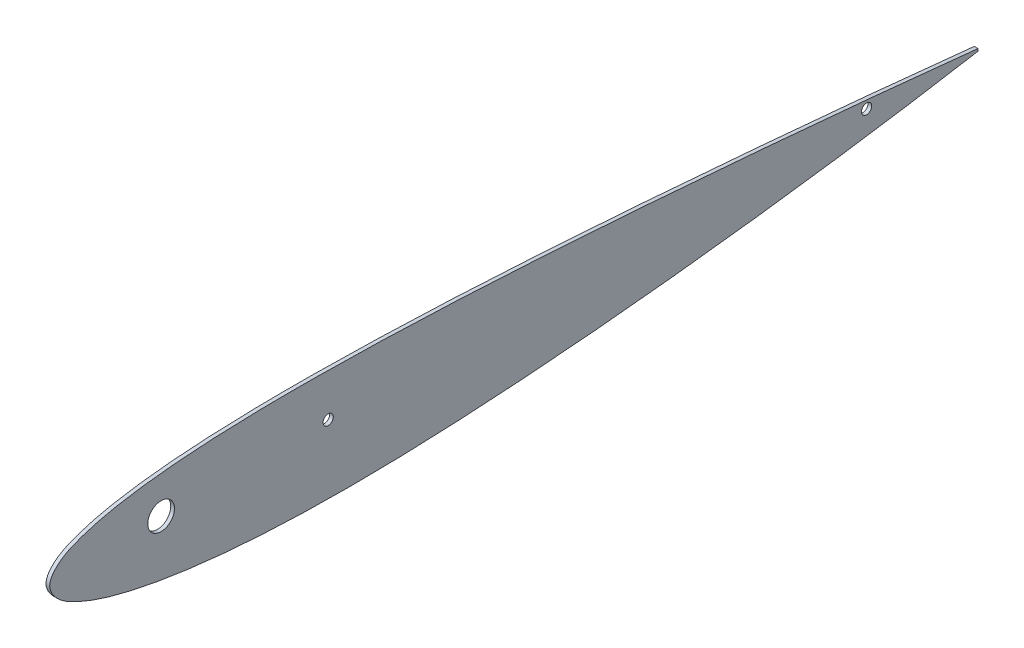
ISO-10303-21;
HEADER;
FILE_DESCRIPTION(('STEP AP214'),'2;1');
FILE_NAME('part.step','',(''),(''),'','','');
FILE_SCHEMA(('AUTOMOTIVE_DESIGN { 1 0 10303 214 1 1 1 1 }'));
ENDSEC;
DATA;
#1=APPLICATION_CONTEXT('core data for automotive mechanical design processes');
#2=APPLICATION_PROTOCOL_DEFINITION('international standard','automotive_design',2000,#1);
#3=PRODUCT_CONTEXT('',#1,'mechanical');
#4=PRODUCT('Part','Part','',(#3));
#5=PRODUCT_RELATED_PRODUCT_CATEGORY('part','',(#4));
#6=PRODUCT_DEFINITION_FORMATION('','',#4);
#7=PRODUCT_DEFINITION_CONTEXT('part definition',#1,'design');
#8=PRODUCT_DEFINITION('design','',#6,#7);
#9=PRODUCT_DEFINITION_SHAPE('','',#8);
#10=(LENGTH_UNIT() NAMED_UNIT(*) SI_UNIT(.MILLI.,.METRE.));
#11=(NAMED_UNIT(*) PLANE_ANGLE_UNIT() SI_UNIT($,.RADIAN.));
#12=(NAMED_UNIT(*) SI_UNIT($,.STERADIAN.) SOLID_ANGLE_UNIT());
#13=UNCERTAINTY_MEASURE_WITH_UNIT(LENGTH_MEASURE(1.E-05),#10,'distance_accuracy_value','');
#14=(GEOMETRIC_REPRESENTATION_CONTEXT(3) GLOBAL_UNCERTAINTY_ASSIGNED_CONTEXT((#13)) GLOBAL_UNIT_ASSIGNED_CONTEXT((#10,
#11,#12)) REPRESENTATION_CONTEXT('',''));
#15=CARTESIAN_POINT('',(0.,0.,0.));
#16=DIRECTION('',(0.,0.,1.));
#17=DIRECTION('',(1.,0.,0.));
#18=AXIS2_PLACEMENT_3D('',#15,#16,#17);
#19=CARTESIAN_POINT('',(2.,0.629990217552887,-500.000391464518));
#20=CARTESIAN_POINT('',(2.,1.51034175126108,-491.626931192415));
#21=CARTESIAN_POINT('',(2.,3.26887282570173,-474.900669551157));
#22=CARTESIAN_POINT('',(2.,6.57755116135666,-441.478024901199));
#23=CARTESIAN_POINT('',(2.,10.4506062125908,-399.75968393433));
#24=CARTESIAN_POINT('',(2.,14.7211772633211,-349.744612358999));
#25=CARTESIAN_POINT('',(2.,18.5892936363402,-299.79981397499));
#26=CARTESIAN_POINT('',(2.,21.8953680882773,-249.907411219679));
#27=CARTESIAN_POINT('',(2.,24.3721381282665,-200.117341253644));
#28=CARTESIAN_POINT('',(2.,25.5592845892216,-158.671272756386));
#29=CARTESIAN_POINT('',(2.,25.7289283148688,-125.568151797292));
#30=CARTESIAN_POINT('',(2.,25.3055282165276,-100.710481376144));
#31=CARTESIAN_POINT('',(2.,24.1073804683215,-75.7898961207131));
#32=CARTESIAN_POINT('',(2.,22.1864488821257,-54.9819243378212));
#33=CARTESIAN_POINT('',(2.,19.6696784029122,-38.2826088337678));
#34=CARTESIAN_POINT('',(2.,17.0750296516133,-25.6214069700581));
#35=CARTESIAN_POINT('',(2.,13.6752084008964,-14.8526657949537));
#36=CARTESIAN_POINT('',(2.,9.34354366510016,-5.48115663478327));
#37=CARTESIAN_POINT('',(2.,0.464115322413722,3.05752115720103));
#38=CARTESIAN_POINT('',(2.,-9.25154410103212,-4.56290295265366));
#39=CARTESIAN_POINT('',(2.,-14.4440662930239,-13.5406941054071));
#40=CARTESIAN_POINT('',(2.,-18.8274349648793,-24.0380165714359));
#41=CARTESIAN_POINT('',(2.,-22.5007793217448,-36.5482015339728));
#42=CARTESIAN_POINT('',(2.,-26.3525527265861,-53.1842112016427));
#43=CARTESIAN_POINT('',(2.,-29.7119988712829,-74.0823714612029));
#44=CARTESIAN_POINT('',(2.,-32.3644363625232,-99.2384453704401));
#45=CARTESIAN_POINT('',(2.,-33.8981341858284,-124.417757669678));
#46=CARTESIAN_POINT('',(2.,-34.8427950054599,-158.001666326896));
#47=CARTESIAN_POINT('',(2.,-34.1504063706173,-199.943449697897));
#48=CARTESIAN_POINT('',(2.,-31.3977787192568,-250.163999372924));
#49=CARTESIAN_POINT('',(2.,-27.3265644902248,-300.273534791434));
#50=CARTESIAN_POINT('',(2.,-22.1260328840813,-350.326490164144));
#51=CARTESIAN_POINT('',(2.,-15.9835680884625,-400.319447211552));
#52=CARTESIAN_POINT('',(2.,-10.0706032745586,-441.907987538052));
#53=CARTESIAN_POINT('',(2.,-4.87163762297868,-475.129555299215));
#54=CARTESIAN_POINT('',(2.,-2.043748956896,-491.710316251138));
#55=CARTESIAN_POINT('',(2.,-0.629990217552892,-499.999608535483));
#56=B_SPLINE_CURVE_WITH_KNOTS('',3,(#19,#20,#21,#22,#23,#24,#25,#26,#27,#28,#29,#30,#31,#32,#33,
#34,#35,#36,#37,#38,#39,#40,#41,#42,#43,#44,#45,#46,#47,#48,#49,#50,#51,#52,#53,#54,#55),
.UNSPECIFIED.,.F.,.F.,(4,1,1,1,1,1,1,1,1,1,1,1,1,1,1,1,1,1,1,1,1,1,1,1,1,1,1,1,1,1,1,1,1,1,4),
(0.,0.0247898444409783,0.049518527668585,0.0988869468263506,0.148148302407342,0.19731261260843,
0.246378146970664,0.295363956929404,0.34408374332352,0.368442721404916,0.392825641810401,
0.41727490319434,0.441884458853984,0.454325923101425,0.466947515660677,0.480022900195665,
0.487092053261674,0.498227884101779,0.509373674616872,0.516476673346114,0.529639133387933,
0.542377969647895,0.5549439711343,0.579861194114865,0.604653843655577,0.629394084082987,
0.654115914552988,0.703559499032186,0.752843021958462,0.802183907321177,0.851568359011207,
0.900997535580195,0.950476794201679,0.975241647297708,1.),.UNSPECIFIED.);
#57=DIRECTION('',(-1.,0.,0.));
#58=VECTOR('',#57,1.);
#59=SURFACE_OF_LINEAR_EXTRUSION('',#56,#58);
#60=CARTESIAN_POINT('',(0.,0.629990217552887,-500.000391464518));
#61=CARTESIAN_POINT('',(0.,1.51034175126108,-491.626931192415));
#62=CARTESIAN_POINT('',(0.,3.26887282570173,-474.900669551157));
#63=CARTESIAN_POINT('',(0.,6.57755116135666,-441.478024901199));
#64=CARTESIAN_POINT('',(0.,10.4506062125908,-399.75968393433));
#65=CARTESIAN_POINT('',(0.,14.7211772633211,-349.744612358999));
#66=CARTESIAN_POINT('',(0.,18.5892936363402,-299.79981397499));
#67=CARTESIAN_POINT('',(0.,21.8953680882773,-249.907411219679));
#68=CARTESIAN_POINT('',(0.,24.3721381282665,-200.117341253644));
#69=CARTESIAN_POINT('',(0.,25.5592845892216,-158.671272756386));
#70=CARTESIAN_POINT('',(0.,25.7289283148688,-125.568151797292));
#71=CARTESIAN_POINT('',(0.,25.3055282165276,-100.710481376144));
#72=CARTESIAN_POINT('',(0.,24.1073804683215,-75.7898961207131));
#73=CARTESIAN_POINT('',(0.,22.1864488821257,-54.9819243378212));
#74=CARTESIAN_POINT('',(0.,19.6696784029122,-38.2826088337678));
#75=CARTESIAN_POINT('',(0.,17.0750296516133,-25.6214069700581));
#76=CARTESIAN_POINT('',(0.,13.6752084008964,-14.8526657949537));
#77=CARTESIAN_POINT('',(0.,9.34354366510016,-5.48115663478327));
#78=CARTESIAN_POINT('',(0.,0.464115322413722,3.05752115720103));
#79=CARTESIAN_POINT('',(0.,-9.25154410103212,-4.56290295265366));
#80=CARTESIAN_POINT('',(0.,-14.4440662930239,-13.5406941054071));
#81=CARTESIAN_POINT('',(0.,-18.8274349648793,-24.0380165714359));
#82=CARTESIAN_POINT('',(0.,-22.5007793217448,-36.5482015339728));
#83=CARTESIAN_POINT('',(0.,-26.3525527265861,-53.1842112016427));
#84=CARTESIAN_POINT('',(0.,-29.7119988712829,-74.0823714612029));
#85=CARTESIAN_POINT('',(0.,-32.3644363625232,-99.2384453704401));
#86=CARTESIAN_POINT('',(0.,-33.8981341858284,-124.417757669678));
#87=CARTESIAN_POINT('',(0.,-34.8427950054599,-158.001666326896));
#88=CARTESIAN_POINT('',(0.,-34.1504063706173,-199.943449697897));
#89=CARTESIAN_POINT('',(0.,-31.3977787192568,-250.163999372924));
#90=CARTESIAN_POINT('',(0.,-27.3265644902248,-300.273534791434));
#91=CARTESIAN_POINT('',(0.,-22.1260328840813,-350.326490164144));
#92=CARTESIAN_POINT('',(0.,-15.9835680884625,-400.319447211552));
#93=CARTESIAN_POINT('',(0.,-10.0706032745586,-441.907987538052));
#94=CARTESIAN_POINT('',(0.,-4.87163762297868,-475.129555299215));
#95=CARTESIAN_POINT('',(0.,-2.043748956896,-491.710316251138));
#96=CARTESIAN_POINT('',(0.,-0.629990217552892,-499.999608535483));
#97=B_SPLINE_CURVE_WITH_KNOTS('',3,(#60,#61,#62,#63,#64,#65,#66,#67,#68,#69,#70,#71,#72,#73,#74,
#75,#76,#77,#78,#79,#80,#81,#82,#83,#84,#85,#86,#87,#88,#89,#90,#91,#92,#93,#94,#95,#96),
.UNSPECIFIED.,.F.,.F.,(4,1,1,1,1,1,1,1,1,1,1,1,1,1,1,1,1,1,1,1,1,1,1,1,1,1,1,1,1,1,1,1,1,1,4),
(0.,0.0247898444409783,0.049518527668585,0.0988869468263506,0.148148302407342,0.19731261260843,
0.246378146970664,0.295363956929404,0.34408374332352,0.368442721404916,0.392825641810401,
0.41727490319434,0.441884458853984,0.454325923101425,0.466947515660677,0.480022900195665,
0.487092053261674,0.498227884101779,0.509373674616872,0.516476673346114,0.529639133387933,
0.542377969647895,0.5549439711343,0.579861194114865,0.604653843655577,0.629394084082987,
0.654115914552988,0.703559499032186,0.752843021958462,0.802183907321177,0.851568359011207,
0.900997535580195,0.950476794201679,0.975241647297708,1.),.UNSPECIFIED.);
#98=CARTESIAN_POINT('',(0.,0.629990217552889,-500.000391464518));
#99=VERTEX_POINT('',#98);
#100=CARTESIAN_POINT('',(0.,-0.629990217552889,-499.999608535482));
#101=VERTEX_POINT('',#100);
#102=EDGE_CURVE('E69',#99,#101,#97,.T.);
#103=ORIENTED_EDGE('',*,*,#102,.T.);
#104=DIRECTION('',(-1.,0.,0.));
#105=VECTOR('',#104,1.);
#106=CARTESIAN_POINT('',(2.,-0.629990217552889,-499.999608535482));
#107=LINE('',#106,#105);
#108=CARTESIAN_POINT('',(2.,-0.629990217552889,-499.999608535482));
#109=VERTEX_POINT('',#108);
#110=EDGE_CURVE('E11',#109,#101,#107,.T.);
#111=ORIENTED_EDGE('',*,*,#110,.F.);
#112=CARTESIAN_POINT('',(2.,0.629990217552889,-500.000391464518));
#113=VERTEX_POINT('',#112);
#114=EDGE_CURVE('E68',#113,#109,#56,.T.);
#115=ORIENTED_EDGE('',*,*,#114,.F.);
#116=DIRECTION('',(-1.,0.,0.));
#117=VECTOR('',#116,1.);
#118=CARTESIAN_POINT('',(2.,0.629990217552889,-500.000391464518));
#119=LINE('',#118,#117);
#120=EDGE_CURVE('E45',#113,#99,#119,.T.);
#121=ORIENTED_EDGE('',*,*,#120,.T.);
#122=EDGE_LOOP('',(#103,#111,#115,#121));
#123=FACE_BOUND('',#122,.T.);
#124=ADVANCED_FACE('F35',(#123),#59,.F.);
#125=CARTESIAN_POINT('',(2.,0.629990217552889,-500.000391464518));
#126=DIRECTION('',(0.,0.000621381778835644,0.999999806942324));
#127=DIRECTION('',(0.,-0.999999806942324,0.000621381778835644));
#128=AXIS2_PLACEMENT_3D('',#125,#126,#127);
#129=PLANE('',#128);
#130=DIRECTION('',(0.,0.999999806942324,-0.000621381778835644));
#131=VECTOR('',#130,1.);
#132=CARTESIAN_POINT('',(0.,0.629990217552889,-500.000391464518));
#133=LINE('',#132,#131);
#134=EDGE_CURVE('E61',#101,#99,#133,.T.);
#135=ORIENTED_EDGE('',*,*,#134,.T.);
#136=ORIENTED_EDGE('',*,*,#120,.F.);
#137=DIRECTION('',(0.,0.999999806942324,-0.000621381778835644));
#138=VECTOR('',#137,1.);
#139=CARTESIAN_POINT('',(2.,0.629990217552889,-500.000391464518));
#140=LINE('',#139,#138);
#141=EDGE_CURVE('E53',#109,#113,#140,.T.);
#142=ORIENTED_EDGE('',*,*,#141,.F.);
#143=ORIENTED_EDGE('',*,*,#110,.T.);
#144=EDGE_LOOP('',(#135,#136,#142,#143));
#145=FACE_BOUND('',#144,.T.);
#146=ADVANCED_FACE('F64',(#145),#129,.F.);
#147=CARTESIAN_POINT('',(2.,-1.37907631788879,-0.144206161930642));
#148=DIRECTION('',(1.,0.,0.));
#149=DIRECTION('',(0.,0.,-1.));
#150=AXIS2_PLACEMENT_3D('',#147,#148,#149);
#151=PLANE('',#150);
#152=CARTESIAN_POINT('',(2.,2.5000018824215,-60.));
#153=DIRECTION('',(1.,0.,0.));
#154=DIRECTION('',(0.,0.,-1.));
#155=AXIS2_PLACEMENT_3D('',#152,#153,#154);
#156=CIRCLE('',#155,7.19536101);
#157=CARTESIAN_POINT('',(2.,2.5000018824215,-67.19536101));
#158=VERTEX_POINT('',#157);
#159=EDGE_CURVE('E86',#158,#158,#156,.T.);
#160=ORIENTED_EDGE('',*,*,#159,.F.);
#161=EDGE_LOOP('',(#160));
#162=FACE_BOUND('',#161,.T.);
#163=CARTESIAN_POINT('',(2.,2.5000018824215,-150.));
#164=DIRECTION('',(1.,0.,0.));
#165=DIRECTION('',(0.,0.,-1.));
#166=AXIS2_PLACEMENT_3D('',#163,#164,#165);
#167=CIRCLE('',#166,2.75000000000001);
#168=CARTESIAN_POINT('',(2.,2.5000018824215,-152.75));
#169=VERTEX_POINT('',#168);
#170=EDGE_CURVE('E163',#169,#169,#167,.T.);
#171=ORIENTED_EDGE('',*,*,#170,.F.);
#172=EDGE_LOOP('',(#171));
#173=FACE_BOUND('',#172,.T.);
#174=CARTESIAN_POINT('',(2.,2.50000188242148,-440.001541872454));
#175=DIRECTION('',(1.,0.,0.));
#176=DIRECTION('',(0.,0.,-1.));
#177=AXIS2_PLACEMENT_3D('',#174,#175,#176);
#178=CIRCLE('',#177,2.75000000000004);
#179=CARTESIAN_POINT('',(2.,2.50000188242148,-442.751541872454));
#180=VERTEX_POINT('',#179);
#181=EDGE_CURVE('E166',#180,#180,#178,.T.);
#182=ORIENTED_EDGE('',*,*,#181,.F.);
#183=EDGE_LOOP('',(#182));
#184=FACE_BOUND('',#183,.T.);
#185=ORIENTED_EDGE('',*,*,#114,.T.);
#186=ORIENTED_EDGE('',*,*,#141,.T.);
#187=EDGE_LOOP('',(#185,#186));
#188=FACE_BOUND('',#187,.T.);
#189=ADVANCED_FACE('F111',(#162,#173,#184,#188),#151,.T.);
#190=CARTESIAN_POINT('',(0.,-1.37907631788879,-0.144206161930642));
#191=DIRECTION('',(1.,0.,0.));
#192=DIRECTION('',(0.,0.,-1.));
#193=AXIS2_PLACEMENT_3D('',#190,#191,#192);
#194=PLANE('',#193);
#195=CARTESIAN_POINT('',(0.,2.5000018824215,-60.));
#196=DIRECTION('',(1.,0.,0.));
#197=DIRECTION('',(0.,0.,-1.));
#198=AXIS2_PLACEMENT_3D('',#195,#196,#197);
#199=CIRCLE('',#198,7.19536101);
#200=CARTESIAN_POINT('',(0.,2.5000018824215,-67.19536101));
#201=VERTEX_POINT('',#200);
#202=EDGE_CURVE('E39',#201,#201,#199,.T.);
#203=ORIENTED_EDGE('',*,*,#202,.T.);
#204=EDGE_LOOP('',(#203));
#205=FACE_BOUND('',#204,.T.);
#206=CARTESIAN_POINT('',(0.,2.5000018824215,-150.));
#207=DIRECTION('',(1.,0.,0.));
#208=DIRECTION('',(0.,0.,-1.));
#209=AXIS2_PLACEMENT_3D('',#206,#207,#208);
#210=CIRCLE('',#209,2.75000000000001);
#211=CARTESIAN_POINT('',(0.,2.5000018824215,-152.75));
#212=VERTEX_POINT('',#211);
#213=EDGE_CURVE('E76',#212,#212,#210,.T.);
#214=ORIENTED_EDGE('',*,*,#213,.T.);
#215=EDGE_LOOP('',(#214));
#216=FACE_BOUND('',#215,.T.);
#217=CARTESIAN_POINT('',(0.,2.50000188242148,-440.001541872454));
#218=DIRECTION('',(1.,0.,0.));
#219=DIRECTION('',(0.,0.,-1.));
#220=AXIS2_PLACEMENT_3D('',#217,#218,#219);
#221=CIRCLE('',#220,2.75000000000004);
#222=CARTESIAN_POINT('',(0.,2.50000188242148,-442.751541872454));
#223=VERTEX_POINT('',#222);
#224=EDGE_CURVE('E84',#223,#223,#221,.T.);
#225=ORIENTED_EDGE('',*,*,#224,.T.);
#226=EDGE_LOOP('',(#225));
#227=FACE_BOUND('',#226,.T.);
#228=ORIENTED_EDGE('',*,*,#102,.F.);
#229=ORIENTED_EDGE('',*,*,#134,.F.);
#230=EDGE_LOOP('',(#228,#229));
#231=FACE_BOUND('',#230,.T.);
#232=ADVANCED_FACE('F73',(#205,#216,#227,#231),#194,.F.);
#233=CARTESIAN_POINT('',(-1.2E-05,2.50000188242148,-440.001541872454));
#234=DIRECTION('',(1.,0.,0.));
#235=DIRECTION('',(0.,0.,-1.));
#236=AXIS2_PLACEMENT_3D('',#233,#234,#235);
#237=CYLINDRICAL_SURFACE('',#236,2.75000000000004);
#238=ORIENTED_EDGE('',*,*,#181,.T.);
#239=EDGE_LOOP('',(#238));
#240=FACE_BOUND('',#239,.T.);
#241=ORIENTED_EDGE('',*,*,#224,.F.);
#242=EDGE_LOOP('',(#241));
#243=FACE_BOUND('',#242,.T.);
#244=ADVANCED_FACE('F95',(#240,#243),#237,.F.);
#245=CARTESIAN_POINT('',(-1.2E-05,2.5000018824215,-150.));
#246=DIRECTION('',(1.,0.,0.));
#247=DIRECTION('',(0.,0.,-1.));
#248=AXIS2_PLACEMENT_3D('',#245,#246,#247);
#249=CYLINDRICAL_SURFACE('',#248,2.75000000000001);
#250=ORIENTED_EDGE('',*,*,#170,.T.);
#251=EDGE_LOOP('',(#250));
#252=FACE_BOUND('',#251,.T.);
#253=ORIENTED_EDGE('',*,*,#213,.F.);
#254=EDGE_LOOP('',(#253));
#255=FACE_BOUND('',#254,.T.);
#256=ADVANCED_FACE('F92',(#252,#255),#249,.F.);
#257=CARTESIAN_POINT('',(-1.2E-05,2.5000018824215,-60.));
#258=DIRECTION('',(1.,0.,0.));
#259=DIRECTION('',(0.,0.,-1.));
#260=AXIS2_PLACEMENT_3D('',#257,#258,#259);
#261=CYLINDRICAL_SURFACE('',#260,7.19536101);
#262=ORIENTED_EDGE('',*,*,#159,.T.);
#263=EDGE_LOOP('',(#262));
#264=FACE_BOUND('',#263,.T.);
#265=ORIENTED_EDGE('',*,*,#202,.F.);
#266=EDGE_LOOP('',(#265));
#267=FACE_BOUND('',#266,.T.);
#268=ADVANCED_FACE('F94',(#264,#267),#261,.F.);
#269=CLOSED_SHELL('',(#124,#146,#189,#232,#244,#256,#268));
#270=MANIFOLD_SOLID_BREP('B2',#269);
#271=ADVANCED_BREP_SHAPE_REPRESENTATION('',(#18,#270),#14);
#272=SHAPE_DEFINITION_REPRESENTATION(#9,#271);
ENDSEC;
END-ISO-10303-21;
